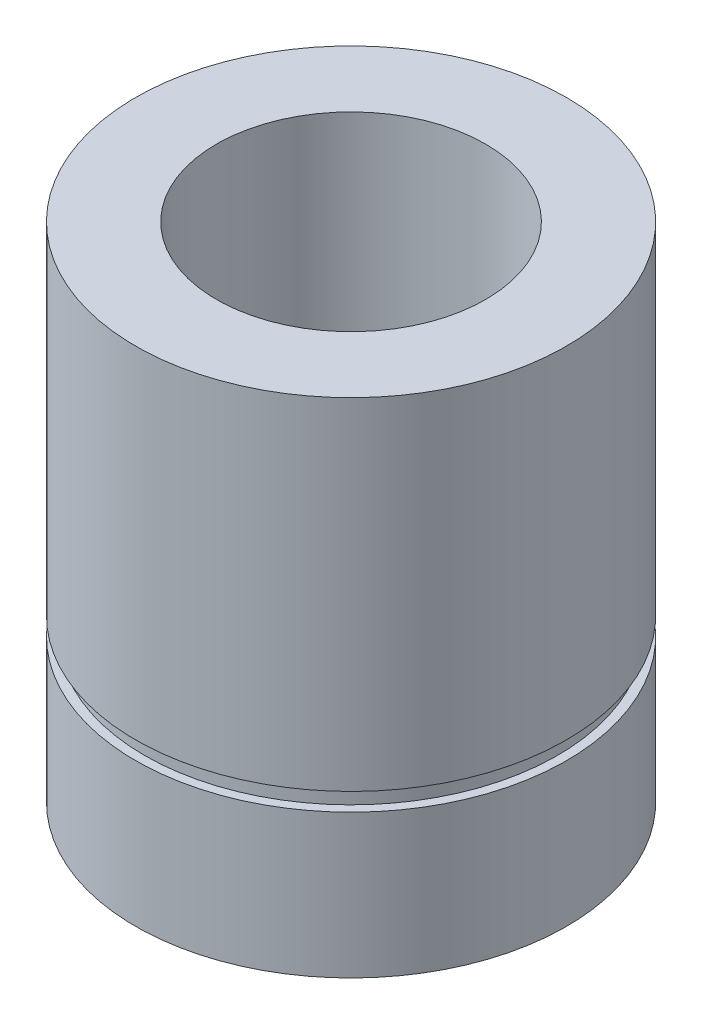
ISO-10303-21;
HEADER;
FILE_DESCRIPTION(('STEP AP214'),'2;1');
FILE_NAME('part.step','',(''),(''),'','','');
FILE_SCHEMA(('AUTOMOTIVE_DESIGN { 1 0 10303 214 1 1 1 1 }'));
ENDSEC;
DATA;
#1=APPLICATION_CONTEXT('core data for automotive mechanical design processes');
#2=APPLICATION_PROTOCOL_DEFINITION('international standard','automotive_design',2000,#1);
#3=PRODUCT_CONTEXT('',#1,'mechanical');
#4=PRODUCT('Part','Part','',(#3));
#5=PRODUCT_RELATED_PRODUCT_CATEGORY('part','',(#4));
#6=PRODUCT_DEFINITION_FORMATION('','',#4);
#7=PRODUCT_DEFINITION_CONTEXT('part definition',#1,'design');
#8=PRODUCT_DEFINITION('design','',#6,#7);
#9=PRODUCT_DEFINITION_SHAPE('','',#8);
#10=(LENGTH_UNIT() NAMED_UNIT(*) SI_UNIT(.MILLI.,.METRE.));
#11=(NAMED_UNIT(*) PLANE_ANGLE_UNIT() SI_UNIT($,.RADIAN.));
#12=(NAMED_UNIT(*) SI_UNIT($,.STERADIAN.) SOLID_ANGLE_UNIT());
#13=UNCERTAINTY_MEASURE_WITH_UNIT(LENGTH_MEASURE(1.E-05),#10,'distance_accuracy_value','');
#14=(GEOMETRIC_REPRESENTATION_CONTEXT(3) GLOBAL_UNCERTAINTY_ASSIGNED_CONTEXT((#13)) GLOBAL_UNIT_ASSIGNED_CONTEXT((#10,
#11,#12)) REPRESENTATION_CONTEXT('',''));
#15=CARTESIAN_POINT('',(0.,0.,0.));
#16=DIRECTION('',(0.,0.,1.));
#17=DIRECTION('',(1.,0.,0.));
#18=AXIS2_PLACEMENT_3D('',#15,#16,#17);
#19=CARTESIAN_POINT('',(0.,28.,0.));
#20=DIRECTION('',(0.,-1.,0.));
#21=DIRECTION('',(0.,0.,-1.));
#22=AXIS2_PLACEMENT_3D('',#19,#20,#21);
#23=CYLINDRICAL_SURFACE('',#22,12.);
#24=CARTESIAN_POINT('',(0.,0.,0.));
#25=DIRECTION('',(0.,-1.,0.));
#26=DIRECTION('',(0.,0.,-1.));
#27=AXIS2_PLACEMENT_3D('',#24,#25,#26);
#28=CIRCLE('',#27,12.);
#29=CARTESIAN_POINT('',(0.,0.,-12.));
#30=VERTEX_POINT('',#29);
#31=EDGE_CURVE('E19',#30,#30,#28,.F.);
#32=ORIENTED_EDGE('',*,*,#31,.T.);
#33=EDGE_LOOP('',(#32));
#34=FACE_BOUND('',#33,.T.);
#35=CARTESIAN_POINT('',(0.,8.,0.));
#36=DIRECTION('',(0.,-1.,0.));
#37=DIRECTION('',(0.,0.,-1.));
#38=AXIS2_PLACEMENT_3D('',#35,#36,#37);
#39=CIRCLE('',#38,12.);
#40=CARTESIAN_POINT('',(0.,8.,-12.));
#41=VERTEX_POINT('',#40);
#42=EDGE_CURVE('E41',#41,#41,#39,.T.);
#43=ORIENTED_EDGE('',*,*,#42,.T.);
#44=EDGE_LOOP('',(#43));
#45=FACE_BOUND('',#44,.T.);
#46=ADVANCED_FACE('F16',(#34,#45),#23,.T.);
#47=CARTESIAN_POINT('',(0.,0.,0.));
#48=DIRECTION('',(0.,1.,0.));
#49=DIRECTION('',(0.,0.,1.));
#50=AXIS2_PLACEMENT_3D('',#47,#48,#49);
#51=PLANE('',#50);
#52=CARTESIAN_POINT('',(0.,0.,0.));
#53=DIRECTION('',(0.,-1.,0.));
#54=DIRECTION('',(0.,0.,-1.));
#55=AXIS2_PLACEMENT_3D('',#52,#53,#54);
#56=CIRCLE('',#55,7.5);
#57=CARTESIAN_POINT('',(0.,0.,-7.5));
#58=VERTEX_POINT('',#57);
#59=EDGE_CURVE('E39',#58,#58,#56,.F.);
#60=ORIENTED_EDGE('',*,*,#59,.T.);
#61=EDGE_LOOP('',(#60));
#62=FACE_BOUND('',#61,.T.);
#63=ORIENTED_EDGE('',*,*,#31,.F.);
#64=EDGE_LOOP('',(#63));
#65=FACE_BOUND('',#64,.T.);
#66=ADVANCED_FACE('F49',(#62,#65),#51,.F.);
#67=CARTESIAN_POINT('',(0.,8.,0.));
#68=DIRECTION('',(0.,-1.,0.));
#69=DIRECTION('',(0.,0.,-1.));
#70=AXIS2_PLACEMENT_3D('',#67,#68,#69);
#71=PLANE('',#70);
#72=CARTESIAN_POINT('',(0.,8.,0.));
#73=DIRECTION('',(0.,1.,0.));
#74=DIRECTION('',(0.,0.,1.));
#75=AXIS2_PLACEMENT_3D('',#72,#73,#74);
#76=CIRCLE('',#75,11.5);
#77=CARTESIAN_POINT('',(0.,8.,11.5));
#78=VERTEX_POINT('',#77);
#79=EDGE_CURVE('E36',#78,#78,#76,.T.);
#80=ORIENTED_EDGE('',*,*,#79,.F.);
#81=EDGE_LOOP('',(#80));
#82=FACE_BOUND('',#81,.T.);
#83=ORIENTED_EDGE('',*,*,#42,.F.);
#84=EDGE_LOOP('',(#83));
#85=FACE_BOUND('',#84,.T.);
#86=ADVANCED_FACE('F51',(#82,#85),#71,.F.);
#87=CARTESIAN_POINT('',(0.,28.,0.));
#88=DIRECTION('',(0.,-1.,0.));
#89=DIRECTION('',(0.,0.,-1.));
#90=AXIS2_PLACEMENT_3D('',#87,#88,#89);
#91=CYLINDRICAL_SURFACE('',#90,7.5);
#92=CARTESIAN_POINT('',(0.,28.,0.));
#93=DIRECTION('',(0.,-1.,0.));
#94=DIRECTION('',(0.,0.,-1.));
#95=AXIS2_PLACEMENT_3D('',#92,#93,#94);
#96=CIRCLE('',#95,7.5);
#97=CARTESIAN_POINT('',(0.,28.,-7.5));
#98=VERTEX_POINT('',#97);
#99=EDGE_CURVE('E33',#98,#98,#96,.T.);
#100=ORIENTED_EDGE('',*,*,#99,.F.);
#101=EDGE_LOOP('',(#100));
#102=FACE_BOUND('',#101,.T.);
#103=ORIENTED_EDGE('',*,*,#59,.F.);
#104=EDGE_LOOP('',(#103));
#105=FACE_BOUND('',#104,.T.);
#106=ADVANCED_FACE('F58',(#102,#105),#91,.F.);
#107=CARTESIAN_POINT('',(0.,8.,0.));
#108=DIRECTION('',(0.,1.,0.));
#109=DIRECTION('',(0.,0.,1.));
#110=AXIS2_PLACEMENT_3D('',#107,#108,#109);
#111=CYLINDRICAL_SURFACE('',#110,11.5);
#112=CARTESIAN_POINT('',(0.,9.,0.));
#113=DIRECTION('',(0.,1.,0.));
#114=DIRECTION('',(0.,0.,1.));
#115=AXIS2_PLACEMENT_3D('',#112,#113,#114);
#116=CIRCLE('',#115,11.5);
#117=CARTESIAN_POINT('',(0.,9.,11.5));
#118=VERTEX_POINT('',#117);
#119=EDGE_CURVE('E28',#118,#118,#116,.T.);
#120=ORIENTED_EDGE('',*,*,#119,.F.);
#121=EDGE_LOOP('',(#120));
#122=FACE_BOUND('',#121,.T.);
#123=ORIENTED_EDGE('',*,*,#79,.T.);
#124=EDGE_LOOP('',(#123));
#125=FACE_BOUND('',#124,.T.);
#126=ADVANCED_FACE('F75',(#122,#125),#111,.T.);
#127=CARTESIAN_POINT('',(0.,28.,0.));
#128=DIRECTION('',(0.,1.,0.));
#129=DIRECTION('',(0.,0.,1.));
#130=AXIS2_PLACEMENT_3D('',#127,#128,#129);
#131=PLANE('',#130);
#132=ORIENTED_EDGE('',*,*,#99,.T.);
#133=EDGE_LOOP('',(#132));
#134=FACE_BOUND('',#133,.T.);
#135=CARTESIAN_POINT('',(0.,28.,0.));
#136=DIRECTION('',(0.,-1.,0.));
#137=DIRECTION('',(0.,0.,-1.));
#138=AXIS2_PLACEMENT_3D('',#135,#136,#137);
#139=CIRCLE('',#138,12.);
#140=CARTESIAN_POINT('',(0.,28.,-12.));
#141=VERTEX_POINT('',#140);
#142=EDGE_CURVE('E23',#141,#141,#139,.T.);
#143=ORIENTED_EDGE('',*,*,#142,.F.);
#144=EDGE_LOOP('',(#143));
#145=FACE_BOUND('',#144,.T.);
#146=ADVANCED_FACE('F68',(#134,#145),#131,.T.);
#147=CARTESIAN_POINT('',(0.,9.,0.));
#148=DIRECTION('',(0.,-1.,0.));
#149=DIRECTION('',(0.,0.,-1.));
#150=AXIS2_PLACEMENT_3D('',#147,#148,#149);
#151=PLANE('',#150);
#152=ORIENTED_EDGE('',*,*,#119,.T.);
#153=EDGE_LOOP('',(#152));
#154=FACE_BOUND('',#153,.T.);
#155=CARTESIAN_POINT('',(0.,9.,0.));
#156=DIRECTION('',(0.,-1.,0.));
#157=DIRECTION('',(0.,0.,-1.));
#158=AXIS2_PLACEMENT_3D('',#155,#156,#157);
#159=CIRCLE('',#158,12.);
#160=CARTESIAN_POINT('',(0.,9.,-12.));
#161=VERTEX_POINT('',#160);
#162=EDGE_CURVE('E10',#161,#161,#159,.F.);
#163=ORIENTED_EDGE('',*,*,#162,.F.);
#164=EDGE_LOOP('',(#163));
#165=FACE_BOUND('',#164,.T.);
#166=ADVANCED_FACE('F63',(#154,#165),#151,.T.);
#167=CARTESIAN_POINT('',(0.,28.,0.));
#168=DIRECTION('',(0.,-1.,0.));
#169=DIRECTION('',(0.,0.,-1.));
#170=AXIS2_PLACEMENT_3D('',#167,#168,#169);
#171=CYLINDRICAL_SURFACE('',#170,12.);
#172=ORIENTED_EDGE('',*,*,#162,.T.);
#173=EDGE_LOOP('',(#172));
#174=FACE_BOUND('',#173,.T.);
#175=ORIENTED_EDGE('',*,*,#142,.T.);
#176=EDGE_LOOP('',(#175));
#177=FACE_BOUND('',#176,.T.);
#178=ADVANCED_FACE('F61',(#174,#177),#171,.T.);
#179=CLOSED_SHELL('',(#46,#66,#86,#106,#126,#146,#166,#178));
#180=MANIFOLD_SOLID_BREP('B1',#179);
#181=ADVANCED_BREP_SHAPE_REPRESENTATION('',(#18,#180),#14);
#182=SHAPE_DEFINITION_REPRESENTATION(#9,#181);
ENDSEC;
END-ISO-10303-21;
